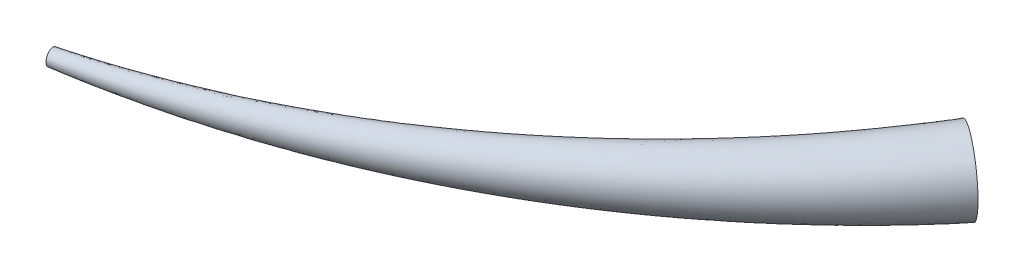
ISO-10303-21;
HEADER;
FILE_DESCRIPTION(('STEP AP214'),'2;1');
FILE_NAME('part.step','',(''),(''),'','','');
FILE_SCHEMA(('AUTOMOTIVE_DESIGN { 1 0 10303 214 1 1 1 1 }'));
ENDSEC;
DATA;
#1=APPLICATION_CONTEXT('core data for automotive mechanical design processes');
#2=APPLICATION_PROTOCOL_DEFINITION('international standard','automotive_design',2000,#1);
#3=PRODUCT_CONTEXT('',#1,'mechanical');
#4=PRODUCT('Part','Part','',(#3));
#5=PRODUCT_RELATED_PRODUCT_CATEGORY('part','',(#4));
#6=PRODUCT_DEFINITION_FORMATION('','',#4);
#7=PRODUCT_DEFINITION_CONTEXT('part definition',#1,'design');
#8=PRODUCT_DEFINITION('design','',#6,#7);
#9=PRODUCT_DEFINITION_SHAPE('','',#8);
#10=(LENGTH_UNIT() NAMED_UNIT(*) SI_UNIT(.MILLI.,.METRE.));
#11=(NAMED_UNIT(*) PLANE_ANGLE_UNIT() SI_UNIT($,.RADIAN.));
#12=(NAMED_UNIT(*) SI_UNIT($,.STERADIAN.) SOLID_ANGLE_UNIT());
#13=UNCERTAINTY_MEASURE_WITH_UNIT(LENGTH_MEASURE(1.E-05),#10,'distance_accuracy_value','');
#14=(GEOMETRIC_REPRESENTATION_CONTEXT(3) GLOBAL_UNCERTAINTY_ASSIGNED_CONTEXT((#13)) GLOBAL_UNIT_ASSIGNED_CONTEXT((#10,
#11,#12)) REPRESENTATION_CONTEXT('',''));
#15=CARTESIAN_POINT('',(0.,0.,0.));
#16=DIRECTION('',(0.,0.,1.));
#17=DIRECTION('',(1.,0.,0.));
#18=AXIS2_PLACEMENT_3D('',#15,#16,#17);
#19=CARTESIAN_POINT('',(7.83721068524795,-0.046232432835548,-5.04607002103196));
#20=DIRECTION('',(-0.570251164361809,0.,0.821470394806776));
#21=DIRECTION('',(0.821470394806776,0.,0.570251164361809));
#22=AXIS2_PLACEMENT_3D('',#19,#20,#21);
#23=PLANE('',#22);
#24=CARTESIAN_POINT('',(7.83721068524795,-0.046232432835548,-5.04607002103196));
#25=DIRECTION('',(-0.570251164361809,0.,0.821470394806776));
#26=DIRECTION('',(0.821470394806776,0.,0.570251164361809));
#27=AXIS2_PLACEMENT_3D('',#24,#25,#26);
#28=CIRCLE('',#27,0.329999165442068);
#29=CARTESIAN_POINT('',(8.10829522996955,-0.0462324328355481,-4.8578876127002));
#30=VERTEX_POINT('',#29);
#31=EDGE_CURVE('E67',#30,#30,#28,.T.);
#32=ORIENTED_EDGE('',*,*,#31,.F.);
#33=EDGE_LOOP('',(#32));
#34=FACE_BOUND('',#33,.T.);
#35=ADVANCED_FACE('F59',(#34),#23,.F.);
#36=CARTESIAN_POINT('',(2.94641982009414,0.,-1.80565072104645));
#37=DIRECTION('',(-0.973139734270832,0.,0.230215241857039));
#38=DIRECTION('',(0.230215241857039,0.,0.973139734270832));
#39=AXIS2_PLACEMENT_3D('',#36,#37,#38);
#40=PLANE('',#39);
#41=CARTESIAN_POINT('',(2.94641982009414,0.,-1.80565072104645));
#42=DIRECTION('',(-0.973139734270832,0.,0.230215241857039));
#43=DIRECTION('',(0.230215241857039,0.,0.973139734270832));
#44=AXIS2_PLACEMENT_3D('',#41,#42,#43);
#45=CIRCLE('',#44,0.0675201180475024);
#46=CARTESIAN_POINT('',(2.96196398040067,0.,-1.73994421131177));
#47=VERTEX_POINT('',#46);
#48=EDGE_CURVE('E12',#47,#47,#45,.T.);
#49=ORIENTED_EDGE('',*,*,#48,.T.);
#50=EDGE_LOOP('',(#49));
#51=FACE_BOUND('',#50,.T.);
#52=ADVANCED_FACE('F109',(#51),#40,.T.);
#53=CARTESIAN_POINT('',(2.96196398040067,0.,-1.73994421131177));
#54=CARTESIAN_POINT('',(5.03025131632468,-0.0154108109451827,-2.12720450609104));
#55=CARTESIAN_POINT('',(6.8617163439912,-0.0308216218903653,-3.24425704852211));
#56=CARTESIAN_POINT('',(8.10829522996955,-0.0462324328355481,-4.8578876127002));
#57=CARTESIAN_POINT('',(2.96196398040067,-0.00186326833110982,-1.73994421131177));
#58=CARTESIAN_POINT('',(5.03025131632468,-0.0196885147104154,-2.12720450609104));
#59=CARTESIAN_POINT('',(6.8617163439912,-0.037513761089721,-3.24425704852211));
#60=CARTESIAN_POINT('',(8.10829522996955,-0.0553390074690267,-4.8578876127002));
#61=CARTESIAN_POINT('',(2.96192915487608,-0.00555475191734497,-1.74009142181558));
#62=CARTESIAN_POINT('',(5.03002565111574,-0.0281634471570628,-2.12744318261453));
#63=CARTESIAN_POINT('',(6.8612998390979,-0.0507721423967807,-3.24458719106528));
#64=CARTESIAN_POINT('',(8.10768788539189,-0.0733808376364986,-4.85830922126305));
#65=CARTESIAN_POINT('',(2.96177645338129,-0.0109693849665731,-1.74073690423832));
#66=CARTESIAN_POINT('',(5.02903616380319,-0.0405943975442466,-2.12848972139162));
#67=CARTESIAN_POINT('',(6.8594735659676,-0.0702194101219202,-3.24603478619672));
#68=CARTESIAN_POINT('',(8.10502482644384,-0.0998444226995939,-4.86015787274884));
#69=CARTESIAN_POINT('',(2.96152730204441,-0.0162439925835052,-1.74179008848367));
#70=CARTESIAN_POINT('',(5.0274216931192,-0.05270387661731,-2.13019727858195));
#71=CARTESIAN_POINT('',(6.85649377593649,-0.0891637606511149,-3.24839671633202));
#72=CARTESIAN_POINT('',(8.10067971706562,-0.12562364468492,-4.86317417582911));
#73=CARTESIAN_POINT('',(2.95947777516563,-0.0469468870782942,-1.75045361582492));
#74=CARTESIAN_POINT('',(5.01414100555272,-0.123191784982969,-2.14424369873156));
#75=CARTESIAN_POINT('',(6.83198192768232,-0.199436682887645,-3.26782602928999));
#76=CARTESIAN_POINT('',(8.06493670812375,-0.27568158079232,-4.88798638159545));
#77=CARTESIAN_POINT('',(2.953283064406,-0.0675201180475024,-1.77663919386867));
#78=CARTESIAN_POINT('',(4.97400002520504,-0.170423944790873,-2.18669911170309));
#79=CARTESIAN_POINT('',(6.75789467774659,-0.273327771534244,-3.3265512771893));
#80=CARTESIAN_POINT('',(7.95690318859997,-0.376231598277616,-4.96298146442254));
#81=CARTESIAN_POINT('',(2.93784076470432,-0.0675201180475024,-1.84191513001868));
#82=CARTESIAN_POINT('',(4.87393578122324,-0.170423944790873,-2.29253281992683));
#83=CARTESIAN_POINT('',(6.57320848948467,-0.273327771534244,-3.47294275748677));
#84=CARTESIAN_POINT('',(7.68759505605793,-0.376231598277616,-5.14993071679374));
#85=CARTESIAN_POINT('',(2.93087565978762,-0.0372653666221962,-1.87135723078113));
#86=CARTESIAN_POINT('',(4.82880273943491,-0.100964886249838,-2.34026812462513));
#87=CARTESIAN_POINT('',(6.48990751082472,-0.16466440587748,-3.53897126612091));
#88=CARTESIAN_POINT('',(7.56612614052635,-0.228363925505122,-5.23425242936373));
#89=CARTESIAN_POINT('',(2.93087565978762,0.0372653666221962,-1.87135723078113));
#90=CARTESIAN_POINT('',(4.82880273943491,0.0701432643594727,-2.34026812462513));
#91=CARTESIAN_POINT('',(6.48990751082472,0.103021162096749,-3.53897126612091));
#92=CARTESIAN_POINT('',(7.56612614052635,0.135899059834026,-5.23425242936373));
#93=CARTESIAN_POINT('',(2.93784076470432,0.0675201180475024,-1.84191513001868));
#94=CARTESIAN_POINT('',(4.87393578122324,0.139602322900508,-2.29253281992683));
#95=CARTESIAN_POINT('',(6.57320848948467,0.211684527753514,-3.47294275748677));
#96=CARTESIAN_POINT('',(7.68759505605793,0.28376673260652,-5.14993071679374));
#97=CARTESIAN_POINT('',(2.953283064406,0.0675201180475024,-1.77663919386867));
#98=CARTESIAN_POINT('',(4.97400002520504,0.139602322900508,-2.18669911170309));
#99=CARTESIAN_POINT('',(6.75789467774659,0.211684527753514,-3.3265512771893));
#100=CARTESIAN_POINT('',(7.95690318859997,0.28376673260652,-4.96298146442254));
#101=CARTESIAN_POINT('',(2.95947777516563,0.0469468870782942,-1.75045361582492));
#102=CARTESIAN_POINT('',(5.01414100555272,0.0923701630926041,-2.14424369873156));
#103=CARTESIAN_POINT('',(6.83198192768232,0.137793439106914,-3.26782602928999));
#104=CARTESIAN_POINT('',(8.06493670812375,0.183216715121224,-4.88798638159545));
#105=CARTESIAN_POINT('',(2.96152730204441,0.0162439925835052,-1.74179008848367));
#106=CARTESIAN_POINT('',(5.0274216931192,0.0218822547269447,-2.13019727858195));
#107=CARTESIAN_POINT('',(6.85649377593649,0.0275205168703842,-3.24839671633202));
#108=CARTESIAN_POINT('',(8.10067971706562,0.0331587790138237,-4.86317417582911));
#109=CARTESIAN_POINT('',(2.96177645338129,0.010969384966573,-1.74073690423832));
#110=CARTESIAN_POINT('',(5.02903616380319,0.00977277565388131,-2.12848972139162));
#111=CARTESIAN_POINT('',(6.8594735659676,0.00857616634118956,-3.24603478619672));
#112=CARTESIAN_POINT('',(8.10502482644384,0.00737955702849774,-4.86015787274884));
#113=CARTESIAN_POINT('',(2.96192915487608,0.00555475191734496,-1.74009142181558));
#114=CARTESIAN_POINT('',(5.03002565111574,-0.00265817473330247,-2.12744318261453));
#115=CARTESIAN_POINT('',(6.8612998390979,-0.0108711013839499,-3.24458719106528));
#116=CARTESIAN_POINT('',(8.10768788539189,-0.0190840280345974,-4.85830922126305));
#117=CARTESIAN_POINT('',(2.96196398040067,0.00186326833110979,-1.73994421131177));
#118=CARTESIAN_POINT('',(5.03025131632468,-0.0111331071799499,-2.12720450609104));
#119=CARTESIAN_POINT('',(6.8617163439912,-0.0241294826910096,-3.24425704852211));
#120=CARTESIAN_POINT('',(8.10829522996955,-0.0371258582020694,-4.8578876127002));
#121=CARTESIAN_POINT('',(2.96196398040067,0.,-1.73994421131177));
#122=CARTESIAN_POINT('',(5.03025131632468,-0.0154108109451827,-2.12720450609104));
#123=CARTESIAN_POINT('',(6.8617163439912,-0.0308216218903653,-3.24425704852211));
#124=CARTESIAN_POINT('',(8.10829522996955,-0.0462324328355481,-4.8578876127002));
#125=B_SPLINE_SURFACE_WITH_KNOTS('',3,3,((#53,#54,#55,#56),(#57,#58,#59,#60),(#61,#62,#63,#64),
(#65,#66,#67,#68),(#69,#70,#71,#72),(#73,#74,#75,#76),(#77,#78,#79,#80),(#81,#82,#83,#84),(#85,
#86,#87,#88),(#89,#90,#91,#92),(#93,#94,#95,#96),(#97,#98,#99,#100),(#101,#102,#103,#104),(#105,
#106,#107,#108),(#109,#110,#111,#112),(#113,#114,#115,#116),(#117,#118,#119,#120),(#121,#122,
#123,#124)),.UNSPECIFIED.,.T.,.F.,.F.,(4,1,1,1,1,2,2,2,1,1,1,1,4),(4,4),(0.,0.0125,
0.0249999999999999,0.0375000000000001,0.05,0.25,0.5,0.75,0.95,0.9625,0.975,0.9875,1.),(0.,1.),.UNSPECIFIED.);
#126=CARTESIAN_POINT('',(2.96196398040067,0.,-1.73994421131177));
#127=CARTESIAN_POINT('',(2.9781165939854,-0.000120353140225661,-1.74296858054418));
#128=CARTESIAN_POINT('',(2.99426066630634,-0.00024075026002501,-1.74603856679741));
#129=CARTESIAN_POINT('',(3.02651955714179,-0.000481544562060399,-1.7522674686351));
#130=CARTESIAN_POINT('',(3.04263438836106,-0.000601941681515042,-1.75542631842555));
#131=CARTESIAN_POINT('',(3.07483446487628,-0.000842735980600591,-1.76183272472501));
#132=CARTESIAN_POINT('',(3.09091972307418,-0.000963133098996378,-1.76508021638785));
#133=CARTESIAN_POINT('',(3.12306032141174,-0.00120392739464805,-1.77166368287395));
#134=CARTESIAN_POINT('',(3.13911567464196,-0.00132432451218319,-1.77499959379086));
#135=CARTESIAN_POINT('',(3.17119613092495,-0.00156511880458452,-1.78175967549112));
#136=CARTESIAN_POINT('',(3.18722124724845,-0.00168551592121387,-1.78518378329913));
#137=CARTESIAN_POINT('',(3.21924089760531,-0.00192631021037064,-1.79212003542789));
#138=CARTESIAN_POINT('',(3.23523544508125,-0.00204670732611499,-1.7956321176958));
#139=CARTESIAN_POINT('',(3.2671936256391,-0.00228750161208147,-1.80274409541758));
#140=CARTESIAN_POINT('',(3.28315727232725,-0.0024078987269448,-1.80634392973258));
#141=CARTESIAN_POINT('',(3.31505331921367,-0.00264869300976316,-1.81363118822539));
#142=CARTESIAN_POINT('',(3.33098573317376,-0.00276909012375474,-1.81731855216986));
#143=CARTESIAN_POINT('',(3.36281898251631,-0.00300988440347127,-1.82478064660828));
#144=CARTESIAN_POINT('',(3.37871983180824,-0.00313028151659975,-1.82855531776605));
#145=CARTESIAN_POINT('',(3.41048961973459,-0.00337107579326052,-1.83619180332575));
#146=CARTESIAN_POINT('',(3.42635857241831,-0.00349147290553548,-1.84005355928037));
#147=CARTESIAN_POINT('',(3.4580642350562,-0.00373226717918747,-1.84786399113691));
#148=CARTESIAN_POINT('',(3.47390095919179,-0.00385266429061903,-1.85181260947214));
#149=CARTESIAN_POINT('',(3.50554183266903,-0.0040934585613098,-1.85979654280129));
#150=CARTESIAN_POINT('',(3.52134599631665,-0.00421385567190868,-1.86383180110099));
#151=CARTESIAN_POINT('',(3.55292141676113,-0.00445464993968649,-1.87198879107862));
#152=CARTESIAN_POINT('',(3.56869268798103,-0.00457504704946399,-1.87611046692676));
#153=CARTESIAN_POINT('',(3.6002019915207,-0.00481584131437771,-1.88444006872892));
#154=CARTESIAN_POINT('',(3.61594003837322,-0.00493623842334573,-1.88864793970957));
#155=CARTESIAN_POINT('',(3.64738256113611,-0.00517703268544487,-1.89714970851243));
#156=CARTESIAN_POINT('',(3.66308705168166,-0.00529742979361585,-1.90144355220979));
#157=CARTESIAN_POINT('',(3.69446212979585,-0.00553822405295055,-1.91011704318968));
#158=CARTESIAN_POINT('',(3.71013273209495,-0.00565862116033751,-1.91449663718805));
#159=CARTESIAN_POINT('',(3.74143970168858,-0.00589941541695852,-1.92334140552143));
#160=CARTESIAN_POINT('',(3.7570760838018,-0.00601981252357502,-1.92780652740525));
#161=CARTESIAN_POINT('',(3.78831428100308,-0.00626060677753367,-1.93682212826873));
#162=CARTESIAN_POINT('',(3.80391611099107,-0.00638100388339382,-1.94137255562255));
#163=CARTESIAN_POINT('',(3.83508487192825,-0.00662179813474205,-1.95055854419289));
#164=CARTESIAN_POINT('',(3.85065181785175,-0.00674219523986048,-1.95519405460137));
#165=CARTESIAN_POINT('',(3.88175047865314,-0.00698298948865081,-1.96454998605547));
#166=CARTESIAN_POINT('',(3.89728220857295,-0.00710338659304269,-1.9692703571034));
#167=CARTESIAN_POINT('',(3.9283101053669,-0.00734418083932819,-1.97879578661833));
#168=CARTESIAN_POINT('',(3.94380628734387,-0.00746457794300919,-1.98360079589062));
#169=CARTESIAN_POINT('',(3.97476275625879,-0.00770537218684352,-1.99329527864357));
#170=CARTESIAN_POINT('',(3.99022305835385,-0.00782576928982982,-1.99818470372526));
#171=CARTESIAN_POINT('',(4.02110743551818,-0.00806656353126716,-2.00804779489359));
#172=CARTESIAN_POINT('',(4.03653152579233,-0.00818696063357544,-2.01302141336984));
#173=CARTESIAN_POINT('',(4.06734314733455,-0.00842775487267053,-2.02305266813104));
#174=CARTESIAN_POINT('',(4.08273069384882,-0.00854815197431794,-2.02811025758714));
#175=CARTESIAN_POINT('',(4.11346889589746,-0.00878894621112604,-2.03830923111886));
#176=CARTESIAN_POINT('',(4.12881956671294,-0.00890934331213023,-2.04345056914023));
#177=CARTESIAN_POINT('',(4.15948368539655,-0.00915013754670712,-2.05381681662028));
#178=CARTESIAN_POINT('',(4.17479714857439,-0.00927053464708619,-2.05904168079245));
#179=CARTESIAN_POINT('',(4.20538652002157,-0.00951132887948816,-2.06957475739878));
#180=CARTESIAN_POINT('',(4.22066244362296,-0.00963172597926067,-2.07488292530743));
#181=CARTESIAN_POINT('',(4.25117640396232,-0.00987252020954452,-2.08558238621815));
#182=CARTESIAN_POINT('',(4.26641445604849,-0.00999291730872948,-2.09097363544907));
#183=CARTESIAN_POINT('',(4.29685234140868,-0.0102337115369525,-2.10183903584243));
#184=CARTESIAN_POINT('',(4.31205219004091,-0.0103541086355694,-2.10731314398156));
#185=CARTESIAN_POINT('',(4.34241333655059,-0.0105949028617893,-2.11834403903597));
#186=CARTESIAN_POINT('',(4.35757464979019,-0.0107152999598579,-2.12390078366937));
#187=CARTESIAN_POINT('',(4.38785839357805,-0.010956094184133,-2.13509672856338));
#188=CARTESIAN_POINT('',(4.40298083948638,-0.0110764912816737,-2.14073588727726));
#189=CARTESIAN_POINT('',(4.43318651668111,-0.0113172855040626,-2.15209643718958));
#190=CARTESIAN_POINT('',(4.44826976331954,-0.0114376826010962,-2.15781778757024));
#191=CARTESIAN_POINT('',(4.47839671004988,-0.011678476821658,-2.16934249767975));
#192=CARTESIAN_POINT('',(4.49344042547981,-0.0117988739182055,-2.17514581731366));
#193=CARTESIAN_POINT('',(4.52348797787448,-0.0120396681369998,-2.18683424279936));
#194=CARTESIAN_POINT('',(4.53849183015735,-0.0121600652330828,-2.19271930927311));
#195=CARTESIAN_POINT('',(4.56845932434509,-0.0124008594501696,-2.20457100531417));
#196=CARTESIAN_POINT('',(4.58342298154235,-0.0125212565458099,-2.21053759621449));
#197=CARTESIAN_POINT('',(4.6133097536519,-0.0127620507612498,-2.22255211799024));
#198=CARTESIAN_POINT('',(4.62823288382502,-0.0128824478564696,-2.22860001090398));
#199=CARTESIAN_POINT('',(4.65803826998514,-0.0131232420703233,-2.24077691359388));
#200=CARTESIAN_POINT('',(4.6729205411956,-0.0132436391651454,-2.24690588610803));
#201=CARTESIAN_POINT('',(4.70264387753505,-0.013484433377474,-2.25924472489172));
#202=CARTESIAN_POINT('',(4.71748495784435,-0.0136048304719214,-2.26545455459341));
#203=CARTESIAN_POINT('',(4.74712558049186,-0.0138456246827867,-2.27795488465065));
#204=CARTESIAN_POINT('',(4.7619251379615,-0.0139660217768826,-2.28424534912714));
#205=CARTESIAN_POINT('',(4.79148238304582,-0.0142068159863465,-2.29690672563787));
#206=CARTESIAN_POINT('',(4.80624008573732,-0.0143272130801147,-2.30327760247654));
#207=CARTESIAN_POINT('',(4.83571328938719,-0.0145680072882396,-2.31609958062085));
#208=CARTESIAN_POINT('',(4.85042880536205,-0.014688404381704,-2.32255064740923));
#209=CARTESIAN_POINT('',(4.8798173037062,-0.0149291985885527,-2.33553278236735));
#210=CARTESIAN_POINT('',(4.89449030102593,-0.0150495956817377,-2.3420638166931));
#211=CARTESIAN_POINT('',(4.92379343019307,-0.0152903898873733,-2.35520566364541));
#212=CARTESIAN_POINT('',(4.93842357691919,-0.0154107869803033,-2.36181644309632));
#213=CARTESIAN_POINT('',(4.96764067303802,-0.0156515811847892,-2.37511755722335));
#214=CARTESIAN_POINT('',(4.98222763723202,-0.0157719782774894,-2.38180785938736));
#215=CARTESIAN_POINT('',(5.01135803643121,-0.0160127724808893,-2.39526779586981));
#216=CARTESIAN_POINT('',(5.02590148615459,-0.0161331695733848,-2.40203739833497));
#217=CARTESIAN_POINT('',(5.05494452456281,-0.0163739637757628,-2.41565571235366));
#218=CARTESIAN_POINT('',(5.06944412787703,-0.0164943608680791,-2.42250439270816));
#219=CARTESIAN_POINT('',(5.09839914162291,-0.0167351550694997,-2.43628063944409));
#220=CARTESIAN_POINT('',(5.11285456658943,-0.0168555521616626,-2.44320817527626));
#221=CARTESIAN_POINT('',(5.14172089180158,-0.0170963463621903,-2.45714190991057));
#222=CARTESIAN_POINT('',(5.15613180648185,-0.0172167434542258,-2.46414807880886));
#223=CARTESIAN_POINT('',(5.18490877928884,-0.0174575376539257,-2.47823885652283));
#224=CARTESIAN_POINT('',(5.19927485174427,-0.0175779347458601,-2.48532343607583));
#225=CARTESIAN_POINT('',(5.22796180827466,-0.0178187289447975,-2.49957081205089));
#226=CARTESIAN_POINT('',(5.24228270656663,-0.0179391260366572,-2.50673357984733));
#227=CARTESIAN_POINT('',(5.27087898294893,-0.0181799202348976,-2.52113710926506));
#228=CARTESIAN_POINT('',(5.28515437513881,-0.0183003173267096,-2.52837784289378));
#229=CARTESIAN_POINT('',(5.31365930750149,-0.0185411115243188,-2.54293708093591));
#230=CARTESIAN_POINT('',(5.3278888616506,-0.0186615086161098,-2.55025555798589));
#231=CARTESIAN_POINT('',(5.3563017861221,-0.0189023028131539,-2.56497005983431));
#232=CARTESIAN_POINT('',(5.37048517029173,-0.0190226999049513,-2.57236605789465));
#233=CARTESIAN_POINT('',(5.39880542300045,-0.0192634941014966,-2.58723537873137));
#234=CARTESIAN_POINT('',(5.41294230525184,-0.0193838911933277,-2.59470867539133));
#235=CARTESIAN_POINT('',(5.44116922232612,-0.0196246853894407,-2.60973237039851));
#236=CARTESIAN_POINT('',(5.4552592707205,-0.0197450824813331,-2.61728274324744));
#237=CARTESIAN_POINT('',(5.48339218828865,-0.0199858766770806,-2.6324603676074));
#238=CARTESIAN_POINT('',(5.49743507088716,-0.020106273769062,-2.64008759423479));
#239=CARTESIAN_POINT('',(5.52547332507743,-0.0203470679645111,-2.65541870312999));
#240=CARTESIAN_POINT('',(5.5394687099412,-0.0204674650566095,-2.66312256112545));
#241=CARTESIAN_POINT('',(5.56741163688178,-0.0207082592518272,-2.67860670973849));
#242=CARTESIAN_POINT('',(5.58135919207188,-0.0208286563440707,-2.68638697669177));
#243=CARTESIAN_POINT('',(5.60920612789092,-0.0210694505391245,-2.70202372020539));
#244=CARTESIAN_POINT('',(5.62310552146835,-0.0211898476315414,-2.70988017370634));
#245=CARTESIAN_POINT('',(5.65085580229393,-0.0214306418264988,-2.72566906730342));
#246=CARTESIAN_POINT('',(5.66470670231964,-0.0215510389191175,-2.73360148494205));
#247=CARTESIAN_POINT('',(5.6923596642798,-0.0217918331140462,-2.7495420838056));
#248=CARTESIAN_POINT('',(5.70616173881468,-0.0219122302068952,-2.75755024317201));
#249=CARTESIAN_POINT('',(5.73371671803737,-0.0221530244018633,-2.77364210248521));
#250=CARTESIAN_POINT('',(5.74746963514226,-0.0222734214949713,-2.78172578116962));
#251=CARTESIAN_POINT('',(5.77492596775537,-0.0225142156900466,-2.79796845611576));
#252=CARTESIAN_POINT('',(5.78862939549102,-0.0226346127834424,-2.80612743170853));
#253=CARTESIAN_POINT('',(5.81598641762239,-0.0228754069786933,-2.82252047747105));
#254=CARTESIAN_POINT('',(5.82964002404951,-0.0229958040724057,-2.83075452756265));
#255=CARTESIAN_POINT('',(5.85689707182689,-0.0232365982679005,-2.84729749932511));
#256=CARTESIAN_POINT('',(5.87050052500608,-0.0233569953619586,-2.85560640150611));
#257=CARTESIAN_POINT('',(5.89765693455716,-0.0235977895577657,-2.87229885445223));
#258=CARTESIAN_POINT('',(5.91120990254897,-0.0237181866521985,-2.88068238631334));
#259=CARTESIAN_POINT('',(5.93826501000136,-0.0239589808483866,-2.89752387562696));
#260=CARTESIAN_POINT('',(5.95176716086626,-0.0240793779432232,-2.90598181475899));
#261=CARTESIAN_POINT('',(5.97872030234749,-0.0243201721398609,-2.92297189562407));
#262=CARTESIAN_POINT('',(5.99217130414586,-0.0244405692351306,-2.93150401961794));
#263=CARTESIAN_POINT('',(6.01902181578338,-0.0246813634322866,-2.94864224721861));
#264=CARTESIAN_POINT('',(6.03242133657552,-0.0248017605280186,-2.95724833366536));
#265=CARTESIAN_POINT('',(6.0591685544967,-0.0250425547257619,-2.97453426318583));
#266=CARTESIAN_POINT('',(6.07251626234283,-0.0251629518219855,-2.9832140896766));
#267=CARTESIAN_POINT('',(6.09915952267494,-0.025403746020385,-3.00064727630125));
#268=CARTESIAN_POINT('',(6.11245508563519,-0.0255241431171295,-3.00940062042729));
#269=CARTESIAN_POINT('',(6.13899372450543,-0.0257649373162542,-3.02698061934061));
#270=CARTESIAN_POINT('',(6.15223681063982,-0.025885334413549,-3.03580725869327));
#271=CARTESIAN_POINT('',(6.1786701641753,-0.0261261286134679,-3.05353362507988));
#272=CARTESIAN_POINT('',(6.19186044154376,-0.0262465257113423,-3.06243333725063));
#273=CARTESIAN_POINT('',(6.21818784587149,-0.0264873199121245,-3.08030562629526));
#274=CARTESIAN_POINT('',(6.23132498253387,-0.0266077170106079,-3.08927818887567));
#275=CARTESIAN_POINT('',(6.25754577378076,-0.0268485112123226,-3.10729595576319));
#276=CARTESIAN_POINT('',(6.27062943779679,-0.0269689083114443,-3.11634114634491));
#277=CARTESIAN_POINT('',(6.29674295208966,-0.0272097025141605,-3.1345039462603));
#278=CARTESIAN_POINT('',(6.30977281151897,-0.0273300996139499,-3.1436215424351));
#279=CARTESIAN_POINT('',(6.33577838498454,-0.0275708938177368,-3.16192893056348));
#280=CARTESIAN_POINT('',(6.34875410788665,-0.0276912909182231,-3.17111870992321));
#281=CARTESIAN_POINT('',(6.37465107665155,-0.0279320851231498,-3.1895702414498));
#282=CARTESIAN_POINT('',(6.38757233108588,-0.0280524822243623,-3.19883198158641));
#283=CARTESIAN_POINT('',(6.4133600312766,-0.028293276430498,-3.21742721169654));
#284=CARTESIAN_POINT('',(6.42622648530245,-0.0284136735324658,-3.22676069020208));
#285=CARTESIAN_POINT('',(6.45190425304541,-0.0286544677398796,-3.24549917408123));
#286=CARTESIAN_POINT('',(6.46471557472198,-0.0287748648426318,-3.25490416854782));
#287=CARTESIAN_POINT('',(6.49028274614347,-0.0290156590513927,-3.27378546138154));
#288=CARTESIAN_POINT('',(6.50303860352981,-0.0291360561549584,-3.28326174940142));
#289=CARTESIAN_POINT('',(6.52849451475602,-0.0293768503651355,-3.3022854063754));
#290=CARTESIAN_POINT('',(6.54119457591109,-0.0294972474695435,-3.31183276554087));
#291=CARTESIAN_POINT('',(6.56653856306808,-0.0297380416812057,-3.33099834184089));
#292=CARTESIAN_POINT('',(6.57918249605072,-0.0298584387864849,-3.34061654974433));
#293=CARTESIAN_POINT('',(6.60441389526445,-0.0300992329997011,-3.3599236005563));
#294=CARTESIAN_POINT('',(6.61700136813335,-0.0302196301058802,-3.3696124347902));
#295=CARTESIAN_POINT('',(6.64211951552965,-0.0304604243207192,-3.38906051530011));
#296=CARTESIAN_POINT('',(6.6546501963434,-0.0305808214278267,-3.398819753457));
#297=CARTESIAN_POINT('',(6.67965442804799,-0.0308216156443571,-3.41840841885097));
#298=CARTESIAN_POINT('',(6.69212798486502,-0.0309420127524216,-3.42823783852349));
#299=CARTESIAN_POINT('',(6.71701763700349,-0.0311828069707121,-3.44796664398773));
#300=CARTESIAN_POINT('',(6.72943373788211,-0.0313032040797618,-3.45786602276857));
#301=CARTESIAN_POINT('',(6.75420814657993,-0.0315439982998807,-3.47773452348938));
#302=CARTESIAN_POINT('',(6.76656645957833,-0.0316643954099437,-3.48770363897131));
#303=CARTESIAN_POINT('',(6.79122496096084,-0.0319051896319594,-3.50771139013511));
#304=CARTESIAN_POINT('',(6.80352515413705,-0.0320255867430636,-3.51775001991096));
#305=CARTESIAN_POINT('',(6.82806708432946,-0.0322663809670443,-3.53789657670425));
#306=CARTESIAN_POINT('',(6.84030882574139,-0.0323867780792175,-3.54800449836693));
#307=CARTESIAN_POINT('',(6.86473352086877,-0.0326275723052312,-3.5682894159763));
#308=CARTESIAN_POINT('',(6.87691647857417,-0.0327479694185008,-3.57846640711877));
#309=CARTESIAN_POINT('',(6.90122327476148,-0.0329887636466154,-3.59888924073091));
#310=CARTESIAN_POINT('',(6.91334711681797,-0.0331091607610088,-3.6091350789462));
#311=CARTESIAN_POINT('',(6.93753535019001,-0.0333499549912919,-3.6296953837479));
#312=CARTESIAN_POINT('',(6.94959974465505,-0.0334703521068361,-3.64000984662908));
#313=CARTESIAN_POINT('',(6.9736687513365,-0.0337111463393552,-3.66070717780719));
#314=CARTESIAN_POINT('',(6.98567336626741,-0.033831543456077,-3.6710900429474));
#315=CARTESIAN_POINT('',(7.0096224823828,-0.0340723376908993,-3.69192395568887));
#316=CARTESIAN_POINT('',(7.02156698583675,-0.0341927348088254,-3.7023750006813));
#317=CARTESIAN_POINT('',(7.04539554751046,-0.0344335290460179,-3.72334505017316));
#318=CARTESIAN_POINT('',(7.05727960754446,-0.0345539261651745,-3.73386405261104));
#319=CARTESIAN_POINT('',(7.08098695090075,-0.0347947204048039,-3.7549697940404));
#320=CARTESIAN_POINT('',(7.09281023557167,-0.034915117525217,-3.765556531517));
#321=CARTESIAN_POINT('',(7.11639569673463,-0.03515591176735,-3.78679752007105));
#322=CARTESIAN_POINT('',(7.12815787409916,-0.0352763088890452,-3.79745177017969));
#323=CARTESIAN_POINT('',(7.15162078919274,-0.035517103133748,-3.81882756104569));
#324=CARTESIAN_POINT('',(7.16332152730744,-0.0356375002567507,-3.82954910137973));
#325=CARTESIAN_POINT('',(7.18666123245545,-0.0358782945040892,-3.85105924974501));
#326=CARTESIAN_POINT('',(7.19830019937669,-0.0359986916284246,-3.86184785789784));
#327=CARTESIAN_POINT('',(7.22151603070278,-0.0362394858784644,-3.8834919189498));
#328=CARTESIAN_POINT('',(7.23309289448679,-0.036359883004157,-3.89434737251485));
#329=CARTESIAN_POINT('',(7.25618418811444,-0.0366006772569637,-3.91612490144096));
#330=CARTESIAN_POINT('',(7.26769861681727,-0.0367210743840378,-3.92704697801166));
#331=CARTESIAN_POINT('',(7.29066470886985,-0.0369618686396763,-3.94895752999945));
#332=CARTESIAN_POINT('',(7.30211637054739,-0.037082265768156,-3.9599460071693));
#333=CARTESIAN_POINT('',(7.32495659714806,-0.0373230600266909,-3.98198913740636));
#334=CARTESIAN_POINT('',(7.33634515985604,-0.0374434571565997,-3.99304379276884));
#335=CARTESIAN_POINT('',(7.35905885712783,-0.0376842514180954,-4.01521905644283));
#336=CARTESIAN_POINT('',(7.3703839889218,-0.0378046485494564,-4.02633966759145));
#337=CARTESIAN_POINT('',(7.39297049298758,-0.0380454428139769,-4.04864661989006));
#338=CARTESIAN_POINT('',(7.40423186192292,-0.0381658399468129,-4.05983296441836));
#339=CARTESIAN_POINT('',(7.42669050890539,-0.0384066342144217,-4.08227116052936));
#340=CARTESIAN_POINT('',(7.43788778303732,-0.0385270313487549,-4.09352301603086));
#341=CARTESIAN_POINT('',(7.46021790905902,-0.0387678256195152,-4.11609201114205));
#342=CARTESIAN_POINT('',(7.47135075644255,-0.0388882227553674,-4.12740915521031));
#343=CARTESIAN_POINT('',(7.49355169762585,-0.0391290170293421,-4.15010850450954));
#344=CARTESIAN_POINT('',(7.50461978631587,-0.0392494141667347,-4.16149071473809));
#345=CARTESIAN_POINT('',(7.52669087878297,-0.0394902084439859,-4.18431997341326));
#346=CARTESIAN_POINT('',(7.53769387683416,-0.0396106055829398,-4.19576702739565));
#347=CARTESIAN_POINT('',(7.5596344567071,-0.0398513998635295,-4.2187257506347));
#348=CARTESIAN_POINT('',(7.57057203217397,-0.039971797004065,-4.23023742596446));
#349=CARTESIAN_POINT('',(7.59238143557461,-0.0402125912880545,-4.25332516895536));
#350=CARTESIAN_POINT('',(7.60325325651148,-0.0403329884301915,-4.26490124322602));
#351=CARTESIAN_POINT('',(7.62493081956152,-0.0405737827176418,-4.28811756115676));
#352=CARTESIAN_POINT('',(7.63573655402254,-0.0406941798613996,-4.29975781196185));
#353=CARTESIAN_POINT('',(7.6572816128435,-0.0409349741523711,-4.32310226002048));
#354=CARTESIAN_POINT('',(7.66802092888265,-0.0410553712977685,-4.33480646495347));
#355=CARTESIAN_POINT('',(7.68943281959586,-0.041296165592321,-4.35827859832805));
#356=CARTESIAN_POINT('',(7.70010538526693,-0.0414165627393762,-4.37004653498244));
#357=CARTESIAN_POINT('',(7.72138344399358,-0.0416573570375692,-4.39364590886104));
#358=CARTESIAN_POINT('',(7.73198892735017,-0.0417777541862997,-4.40547735483027));
#359=CARTESIAN_POINT('',(7.75313249021124,-0.042018548488192,-4.42920352440101));
#360=CARTESIAN_POINT('',(7.76367055930678,-0.0421389456386148,-4.44109825727849));
#361=CARTESIAN_POINT('',(7.78467896242307,-0.0423797399442646,-4.46495077772949));
#362=CARTESIAN_POINT('',(7.79514928531081,-0.0425001370963963,-4.47690857510861));
#363=CARTESIAN_POINT('',(7.81602186480297,-0.0427409314058613,-4.500887001628));
#364=CARTESIAN_POINT('',(7.82642410953595,-0.0428613285597174,-4.51290764110211));
#365=CARTESIAN_POINT('',(7.84716020152444,-0.0431021228730546,-4.53701152887802));
#366=CARTESIAN_POINT('',(7.85749403615556,-0.0432225200286504,-4.5490947880404));
#367=CARTESIAN_POINT('',(7.8780929767606,-0.0434633143459164,-4.57332369226103));
#368=CARTESIAN_POINT('',(7.88835806934248,-0.0435837115032663,-4.585469348705));
#369=CARTESIAN_POINT('',(7.90881919468432,-0.0438245058245164,-4.60982282455831));
#370=CARTESIAN_POINT('',(7.91901521326969,-0.0439449029836336,-4.62203065587683));
#371=CARTESIAN_POINT('',(7.93933785946766,-0.044185697308925,-4.64650825855166));
#372=CARTESIAN_POINT('',(7.94946447210806,-0.0443060944698253,-4.65877804233881));
#373=CARTESIAN_POINT('',(7.96964797528399,-0.0445468887992046,-4.68337932702074));
#374=CARTESIAN_POINT('',(7.97970485003443,-0.0446672859618894,-4.69571084086609));
#375=CARTESIAN_POINT('',(7.99974854629999,-0.0449080802954402,-4.72043536275281));
#376=CARTESIAN_POINT('',(8.0097353512017,-0.0450284774599619,-4.73282838426245));
#377=CARTESIAN_POINT('',(8.02963857670556,-0.045269271797626,-4.75767569850641));
#378=CARTESIAN_POINT('',(8.03955497985036,-0.0453896689638433,-4.77013000522454));
#379=CARTESIAN_POINT('',(8.05931707060223,-0.0456304633060885,-4.79509966714701));
#380=CARTESIAN_POINT('',(8.06916273989216,-0.0457508604745794,-4.80761503684846));
#381=CARTESIAN_POINT('',(8.08878303241961,-0.0459916548199059,-4.83270660114035));
#382=CARTESIAN_POINT('',(8.09855763646439,-0.0461120519885595,-4.84528281073858));
#383=CARTESIAN_POINT('',(8.10829522996955,-0.0462324328355481,-4.8578876127002));
#384=B_SPLINE_CURVE_WITH_KNOTS('',3,(#126,#127,#128,#129,#130,#131,#132,#133,#134,#135,#136,
#137,#138,#139,#140,#141,#142,#143,#144,#145,#146,#147,#148,#149,#150,#151,#152,#153,#154,#155,
#156,#157,#158,#159,#160,#161,#162,#163,#164,#165,#166,#167,#168,#169,#170,#171,#172,#173,#174,
#175,#176,#177,#178,#179,#180,#181,#182,#183,#184,#185,#186,#187,#188,#189,#190,#191,#192,#193,
#194,#195,#196,#197,#198,#199,#200,#201,#202,#203,#204,#205,#206,#207,#208,#209,#210,#211,#212,
#213,#214,#215,#216,#217,#218,#219,#220,#221,#222,#223,#224,#225,#226,#227,#228,#229,#230,#231,
#232,#233,#234,#235,#236,#237,#238,#239,#240,#241,#242,#243,#244,#245,#246,#247,#248,#249,#250,
#251,#252,#253,#254,#255,#256,#257,#258,#259,#260,#261,#262,#263,#264,#265,#266,#267,#268,#269,
#270,#271,#272,#273,#274,#275,#276,#277,#278,#279,#280,#281,#282,#283,#284,#285,#286,#287,#288,
#289,#290,#291,#292,#293,#294,#295,#296,#297,#298,#299,#300,#301,#302,#303,#304,#305,#306,#307,
#308,#309,#310,#311,#312,#313,#314,#315,#316,#317,#318,#319,#320,#321,#322,#323,#324,#325,#326,
#327,#328,#329,#330,#331,#332,#333,#334,#335,#336,#337,#338,#339,#340,#341,#342,#343,#344,#345,
#346,#347,#348,#349,#350,#351,#352,#353,#354,#355,#356,#357,#358,#359,#360,#361,#362,#363,#364,
#365,#366,#367,#368,#369,#370,#371,#372,#373,#374,#375,#376,#377,#378,#379,#380,#381,#382,#383),
.UNSPECIFIED.,.F.,.F.,(4,2,2,2,2,2,2,2,2,2,2,2,2,2,2,2,2,2,2,2,2,2,2,2,2,2,2,2,2,2,2,2,2,2,2,2,
2,2,2,2,2,2,2,2,2,2,2,2,2,2,2,2,2,2,2,2,2,2,2,2,2,2,2,2,2,2,2,2,2,2,2,2,2,2,2,2,2,2,2,2,2,2,2,2,
2,2,2,2,2,2,2,2,2,2,2,2,2,2,2,2,2,2,2,2,2,2,2,2,2,2,2,2,2,2,2,2,2,2,2,2,2,2,2,2,2,2,2,2,4),(0.,
0.049301192195058,0.0985667959530847,0.147797277337281,0.196993097976598,0.246154715127818,
0.295282581738275,0.344377146509187,0.393438853959599,0.442468144490924,0.491465454452069,
0.540431216205146,0.589365858191743,0.638269804999765,0.687143477430811,0.7359872925681,
0.784801663844926,0.833587001113627,0.882343710715068,0.931072195548634,0.979772855142695,
1.02844608572558,1.07709228029698,1.12571182869987,1.17430511769287,1.222872531023,
1.27141444949893,1.31993125106463,1.36842331087348,1.41689100136269,1.46533469232826,
1.51375475100018,1.56215154211814,1.61052542800753,1.65887676865584,1.70720592178944,
1.75551324295063,1.8037990855751,1.85206380106968,1.90030773889048,1.94853124662121,
1.99673467005193,2.04491835325805,2.09308263867962,2.14122786720087,2.18935437823006,
2.2374625097796,2.28555259854638,2.33362497999237,2.38167998842548,2.42971795708061,
2.47773921820093,2.52574410311939,2.57373294234046,2.62170606562195,2.66966380205721,
2.71760648015729,2.76553442793347,2.81344797297984,2.86134744255602,2.90923316367014,
2.95710546316185,3.00496466778551,3.05281110429347,3.10064509951952,3.14846698046241,
3.19627707436943,3.24407570882017,3.29186321181028,3.33963991183534,3.38740613797476,
3.43516221997582,3.48290848833762,3.53064527439521,3.57837291040362,3.62609172962202,
3.67380206639783,3.72150425625081,3.76919863595721,3.81688554363388,3.86456531882229,
3.91223830257261,3.9599048375277,4.00756526800703,4.05521994009055,4.10286920170254,
4.15051340269525,4.19815289493257,4.24578803237357,4.29341917115583,4.34104666967879,
4.38867088868688,4.4362921913525,4.48391094335888,4.53152751298274,4.57914227117683,
4.6267555916522,4.67436785096033,4.72197942857503,4.76959070697411,4.81720207172082,
4.86481391154506,4.91242661842431,4.96004058766429,5.00765621797935,5.05527391157255,
5.1028940742155,5.15051711532771,5.19814344805584,5.24577348935239,5.29340766005419,
5.34104638496042,5.38869009291028,5.43633921686027,5.48399419396103,5.53165546563379,
5.57932347764633,5.62699868018855,5.67468152794749,5.72237248018196,5.77007200079659,
5.81778055841543,5.86549862645494,5.91322668319657,5.96096521185864,6.00871470066774,
6.05647564292952,6.10424853709887,6.15203388684944),.UNSPECIFIED.);
#385=EDGE_CURVE('BSEAM92',#47,#30,#384,.T.);
#386=ORIENTED_EDGE('',*,*,#48,.F.);
#387=ORIENTED_EDGE('',*,*,#31,.T.);
#388=ORIENTED_EDGE('',*,*,#385,.T.);
#389=ORIENTED_EDGE('',*,*,#385,.F.);
#390=EDGE_LOOP('',(#386,#388,#387,#389));
#391=FACE_BOUND('',#390,.T.);
#392=ADVANCED_FACE('F92',(#391),#125,.T.);
#393=CLOSED_SHELL('',(#35,#52,#392));
#394=MANIFOLD_SOLID_BREP('B2',#393);
#395=ADVANCED_BREP_SHAPE_REPRESENTATION('',(#18,#394),#14);
#396=SHAPE_DEFINITION_REPRESENTATION(#9,#395);
ENDSEC;
END-ISO-10303-21;
